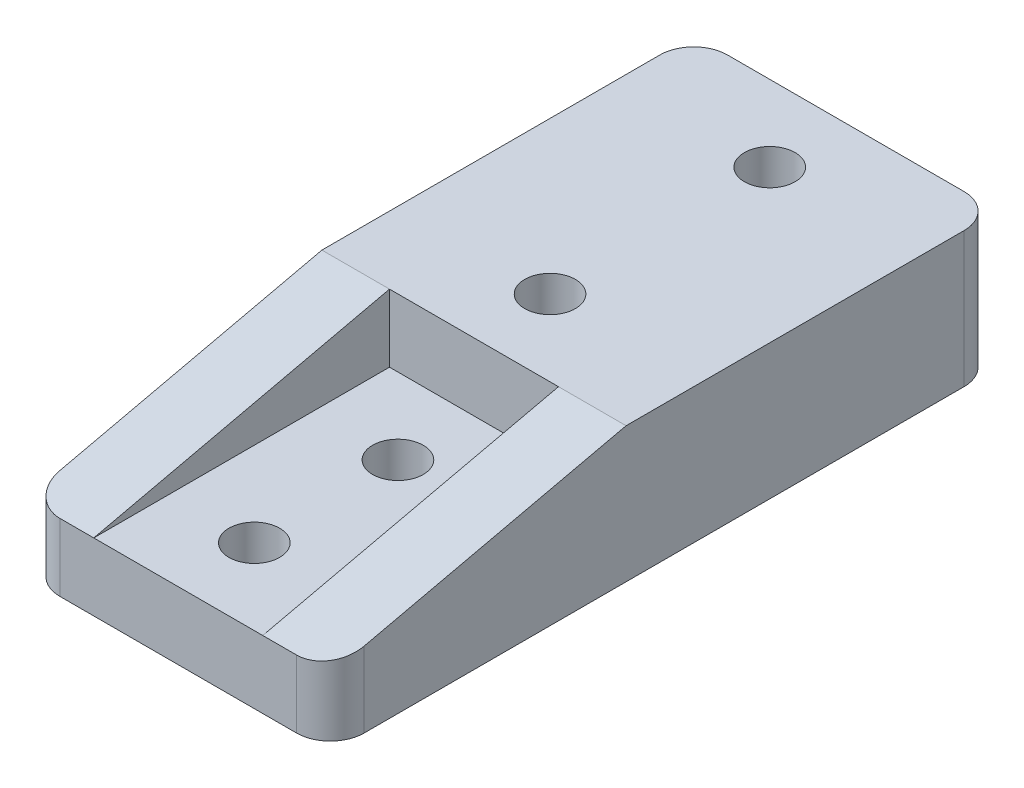
ISO-10303-21;
HEADER;
FILE_DESCRIPTION(('STEP AP214'),'2;1');
FILE_NAME('part.step','',(''),(''),'','','');
FILE_SCHEMA(('AUTOMOTIVE_DESIGN { 1 0 10303 214 1 1 1 1 }'));
ENDSEC;
DATA;
#1=APPLICATION_CONTEXT('core data for automotive mechanical design processes');
#2=APPLICATION_PROTOCOL_DEFINITION('international standard','automotive_design',2000,#1);
#3=PRODUCT_CONTEXT('',#1,'mechanical');
#4=PRODUCT('Part','Part','',(#3));
#5=PRODUCT_RELATED_PRODUCT_CATEGORY('part','',(#4));
#6=PRODUCT_DEFINITION_FORMATION('','',#4);
#7=PRODUCT_DEFINITION_CONTEXT('part definition',#1,'design');
#8=PRODUCT_DEFINITION('design','',#6,#7);
#9=PRODUCT_DEFINITION_SHAPE('','',#8);
#10=(LENGTH_UNIT() NAMED_UNIT(*) SI_UNIT(.MILLI.,.METRE.));
#11=(NAMED_UNIT(*) PLANE_ANGLE_UNIT() SI_UNIT($,.RADIAN.));
#12=(NAMED_UNIT(*) SI_UNIT($,.STERADIAN.) SOLID_ANGLE_UNIT());
#13=UNCERTAINTY_MEASURE_WITH_UNIT(LENGTH_MEASURE(1.E-05),#10,'distance_accuracy_value','');
#14=(GEOMETRIC_REPRESENTATION_CONTEXT(3) GLOBAL_UNCERTAINTY_ASSIGNED_CONTEXT((#13)) GLOBAL_UNIT_ASSIGNED_CONTEXT((#10,
#11,#12)) REPRESENTATION_CONTEXT('',''));
#15=CARTESIAN_POINT('',(0.,0.,0.));
#16=DIRECTION('',(0.,0.,1.));
#17=DIRECTION('',(1.,0.,0.));
#18=AXIS2_PLACEMENT_3D('',#15,#16,#17);
#19=CARTESIAN_POINT('',(0.,0.,6.));
#20=DIRECTION('',(0.,1.,0.));
#21=DIRECTION('',(0.,0.,1.));
#22=AXIS2_PLACEMENT_3D('',#19,#20,#21);
#23=CYLINDRICAL_SURFACE('',#22,1.5);
#24=CARTESIAN_POINT('',(0.,8.,6.));
#25=DIRECTION('',(0.,1.,0.));
#26=DIRECTION('',(0.,0.,1.));
#27=AXIS2_PLACEMENT_3D('',#24,#25,#26);
#28=CIRCLE('',#27,1.5);
#29=CARTESIAN_POINT('',(0.,8.,7.5));
#30=VERTEX_POINT('',#29);
#31=EDGE_CURVE('E347',#30,#30,#28,.T.);
#32=ORIENTED_EDGE('',*,*,#31,.T.);
#33=EDGE_LOOP('',(#32));
#34=FACE_BOUND('',#33,.T.);
#35=CARTESIAN_POINT('',(0.,3.,6.));
#36=DIRECTION('',(0.,-1.,0.));
#37=DIRECTION('',(0.,0.,-1.));
#38=AXIS2_PLACEMENT_3D('',#35,#36,#37);
#39=CIRCLE('',#38,1.5);
#40=CARTESIAN_POINT('',(0.,3.,4.5));
#41=VERTEX_POINT('',#40);
#42=EDGE_CURVE('E206',#41,#41,#39,.F.);
#43=ORIENTED_EDGE('',*,*,#42,.F.);
#44=EDGE_LOOP('',(#43));
#45=FACE_BOUND('',#44,.T.);
#46=ADVANCED_FACE('F31',(#34,#45),#23,.F.);
#47=CARTESIAN_POINT('',(-8.99999999999999,8.,28.));
#48=DIRECTION('',(0.,0.,-1.));
#49=DIRECTION('',(-1.,0.,0.));
#50=AXIS2_PLACEMENT_3D('',#47,#48,#49);
#51=PLANE('',#50);
#52=DIRECTION('',(1.,0.,0.));
#53=VECTOR('',#52,1.);
#54=CARTESIAN_POINT('',(-9.,4.,28.));
#55=LINE('',#54,#53);
#56=CARTESIAN_POINT('',(-6.99999999999999,4.,28.));
#57=VERTEX_POINT('',#56);
#58=CARTESIAN_POINT('',(-5.,4.,28.));
#59=VERTEX_POINT('',#58);
#60=EDGE_CURVE('E154',#57,#59,#55,.T.);
#61=ORIENTED_EDGE('',*,*,#60,.F.);
#62=DIRECTION('',(0.,-1.,0.));
#63=VECTOR('',#62,1.);
#64=CARTESIAN_POINT('',(-6.99999999999999,8.,28.));
#65=LINE('',#64,#63);
#66=CARTESIAN_POINT('',(-6.99999999999999,0.,28.));
#67=VERTEX_POINT('',#66);
#68=EDGE_CURVE('E189',#57,#67,#65,.T.);
#69=ORIENTED_EDGE('',*,*,#68,.T.);
#70=DIRECTION('',(1.,0.,0.));
#71=VECTOR('',#70,1.);
#72=CARTESIAN_POINT('',(-8.99999999999999,0.,28.));
#73=LINE('',#72,#71);
#74=CARTESIAN_POINT('',(7.,0.,28.));
#75=VERTEX_POINT('',#74);
#76=EDGE_CURVE('E182',#67,#75,#73,.T.);
#77=ORIENTED_EDGE('',*,*,#76,.T.);
#78=DIRECTION('',(0.,-1.,0.));
#79=VECTOR('',#78,1.);
#80=CARTESIAN_POINT('',(7.,8.,28.));
#81=LINE('',#80,#79);
#82=CARTESIAN_POINT('',(7.,4.,28.));
#83=VERTEX_POINT('',#82);
#84=EDGE_CURVE('E180',#75,#83,#81,.F.);
#85=ORIENTED_EDGE('',*,*,#84,.T.);
#86=CARTESIAN_POINT('',(5.,4.,28.));
#87=VERTEX_POINT('',#86);
#88=EDGE_CURVE('E143',#87,#83,#55,.T.);
#89=ORIENTED_EDGE('',*,*,#88,.F.);
#90=DIRECTION('',(1.,0.,0.));
#91=VECTOR('',#90,1.);
#92=CARTESIAN_POINT('',(-33.9048816350654,4.,28.));
#93=LINE('',#92,#91);
#94=EDGE_CURVE('E167',#59,#87,#93,.T.);
#95=ORIENTED_EDGE('',*,*,#94,.F.);
#96=EDGE_LOOP('',(#61,#69,#77,#85,#89,#95));
#97=FACE_BOUND('',#96,.T.);
#98=ADVANCED_FACE('F240',(#97),#51,.F.);
#99=CARTESIAN_POINT('',(-8.99999999999999,8.,28.));
#100=DIRECTION('',(0.,1.,0.));
#101=DIRECTION('',(0.,0.,1.));
#102=AXIS2_PLACEMENT_3D('',#99,#100,#101);
#103=PLANE('',#102);
#104=CARTESIAN_POINT('',(0.,8.,-7.));
#105=DIRECTION('',(0.,1.,0.));
#106=DIRECTION('',(0.,0.,1.));
#107=AXIS2_PLACEMENT_3D('',#104,#105,#106);
#108=CIRCLE('',#107,1.5);
#109=CARTESIAN_POINT('',(0.,8.,-5.5));
#110=VERTEX_POINT('',#109);
#111=EDGE_CURVE('E341',#110,#110,#108,.T.);
#112=ORIENTED_EDGE('',*,*,#111,.F.);
#113=EDGE_LOOP('',(#112));
#114=FACE_BOUND('',#113,.T.);
#115=ORIENTED_EDGE('',*,*,#31,.F.);
#116=EDGE_LOOP('',(#115));
#117=FACE_BOUND('',#116,.T.);
#118=DIRECTION('',(-1.,0.,0.));
#119=VECTOR('',#118,1.);
#120=CARTESIAN_POINT('',(-9.,8.,-11.5));
#121=LINE('',#120,#119);
#122=CARTESIAN_POINT('',(6.99999999999999,8.,-11.5));
#123=VERTEX_POINT('',#122);
#124=CARTESIAN_POINT('',(-7.,8.,-11.5));
#125=VERTEX_POINT('',#124);
#126=EDGE_CURVE('E178',#123,#125,#121,.T.);
#127=ORIENTED_EDGE('',*,*,#126,.T.);
#128=CARTESIAN_POINT('',(-7.,8.,-9.5));
#129=DIRECTION('',(0.,1.,0.));
#130=DIRECTION('',(0.,0.,1.));
#131=AXIS2_PLACEMENT_3D('',#128,#129,#130);
#132=CIRCLE('',#131,2.);
#133=CARTESIAN_POINT('',(-9.,8.,-9.5));
#134=VERTEX_POINT('',#133);
#135=EDGE_CURVE('E39',#125,#134,#132,.T.);
#136=ORIENTED_EDGE('',*,*,#135,.T.);
#137=DIRECTION('',(0.,0.,1.));
#138=VECTOR('',#137,1.);
#139=CARTESIAN_POINT('',(-9.,8.,-11.5));
#140=LINE('',#139,#138);
#141=CARTESIAN_POINT('',(-9.,8.,10.5));
#142=VERTEX_POINT('',#141);
#143=EDGE_CURVE('E122',#134,#142,#140,.T.);
#144=ORIENTED_EDGE('',*,*,#143,.T.);
#145=DIRECTION('',(1.,0.,0.));
#146=VECTOR('',#145,1.);
#147=CARTESIAN_POINT('',(-9.,8.,10.5));
#148=LINE('',#147,#146);
#149=CARTESIAN_POINT('',(-5.,8.,10.5));
#150=VERTEX_POINT('',#149);
#151=EDGE_CURVE('E127',#142,#150,#148,.T.);
#152=ORIENTED_EDGE('',*,*,#151,.T.);
#153=DIRECTION('',(1.,0.,0.));
#154=VECTOR('',#153,1.);
#155=CARTESIAN_POINT('',(-33.9048816350654,8.,10.5));
#156=LINE('',#155,#154);
#157=CARTESIAN_POINT('',(5.,8.,10.5));
#158=VERTEX_POINT('',#157);
#159=EDGE_CURVE('E159',#150,#158,#156,.T.);
#160=ORIENTED_EDGE('',*,*,#159,.T.);
#161=CARTESIAN_POINT('',(9.,8.,10.5));
#162=VERTEX_POINT('',#161);
#163=EDGE_CURVE('E149',#158,#162,#148,.T.);
#164=ORIENTED_EDGE('',*,*,#163,.T.);
#165=DIRECTION('',(0.,0.,-1.));
#166=VECTOR('',#165,1.);
#167=CARTESIAN_POINT('',(9.,8.,-11.5));
#168=LINE('',#167,#166);
#169=CARTESIAN_POINT('',(9.,8.,-9.5));
#170=VERTEX_POINT('',#169);
#171=EDGE_CURVE('E133',#162,#170,#168,.T.);
#172=ORIENTED_EDGE('',*,*,#171,.T.);
#173=CARTESIAN_POINT('',(6.99999999999999,8.,-9.5));
#174=DIRECTION('',(0.,1.,0.));
#175=DIRECTION('',(0.,0.,1.));
#176=AXIS2_PLACEMENT_3D('',#173,#174,#175);
#177=CIRCLE('',#176,2.);
#178=EDGE_CURVE('E220',#170,#123,#177,.T.);
#179=ORIENTED_EDGE('',*,*,#178,.T.);
#180=EDGE_LOOP('',(#127,#136,#144,#152,#160,#164,#172,#179));
#181=FACE_BOUND('',#180,.T.);
#182=ADVANCED_FACE('F124',(#114,#117,#181),#103,.T.);
#183=CARTESIAN_POINT('',(-9.,8.,-11.5));
#184=DIRECTION('',(1.,0.,0.));
#185=DIRECTION('',(0.,0.,-1.));
#186=AXIS2_PLACEMENT_3D('',#183,#184,#185);
#187=PLANE('',#186);
#188=ORIENTED_EDGE('',*,*,#143,.F.);
#189=DIRECTION('',(0.,-1.,0.));
#190=VECTOR('',#189,1.);
#191=CARTESIAN_POINT('',(-9.,8.,-9.5));
#192=LINE('',#191,#190);
#193=CARTESIAN_POINT('',(-9.,0.,-9.5));
#194=VERTEX_POINT('',#193);
#195=EDGE_CURVE('E205',#134,#194,#192,.T.);
#196=ORIENTED_EDGE('',*,*,#195,.T.);
#197=DIRECTION('',(0.,0.,1.));
#198=VECTOR('',#197,1.);
#199=CARTESIAN_POINT('',(-9.,0.,-11.5));
#200=LINE('',#199,#198);
#201=CARTESIAN_POINT('',(-8.99999999999999,0.,26.));
#202=VERTEX_POINT('',#201);
#203=EDGE_CURVE('E174',#194,#202,#200,.T.);
#204=ORIENTED_EDGE('',*,*,#203,.T.);
#205=DIRECTION('',(0.,-1.,0.));
#206=VECTOR('',#205,1.);
#207=CARTESIAN_POINT('',(-8.99999999999999,8.,26.));
#208=LINE('',#207,#206);
#209=CARTESIAN_POINT('',(-9.,4.45714285714286,26.));
#210=VERTEX_POINT('',#209);
#211=EDGE_CURVE('E140',#202,#210,#208,.F.);
#212=ORIENTED_EDGE('',*,*,#211,.T.);
#213=DIRECTION('',(0.,0.222824801502141,-0.974858506571867));
#214=VECTOR('',#213,1.);
#215=CARTESIAN_POINT('',(-9.,4.,28.));
#216=LINE('',#215,#214);
#217=EDGE_CURVE('E137',#210,#142,#216,.T.);
#218=ORIENTED_EDGE('',*,*,#217,.T.);
#219=EDGE_LOOP('',(#188,#196,#204,#212,#218));
#220=FACE_BOUND('',#219,.T.);
#221=ADVANCED_FACE('F138',(#220),#187,.F.);
#222=CARTESIAN_POINT('',(9.,8.,-11.5));
#223=DIRECTION('',(-1.,0.,0.));
#224=DIRECTION('',(0.,0.,1.));
#225=AXIS2_PLACEMENT_3D('',#222,#223,#224);
#226=PLANE('',#225);
#227=DIRECTION('',(0.,0.,-1.));
#228=VECTOR('',#227,1.);
#229=CARTESIAN_POINT('',(9.,0.,-11.5));
#230=LINE('',#229,#228);
#231=CARTESIAN_POINT('',(9.,0.,26.));
#232=VERTEX_POINT('',#231);
#233=CARTESIAN_POINT('',(9.,0.,-9.5));
#234=VERTEX_POINT('',#233);
#235=EDGE_CURVE('E185',#232,#234,#230,.T.);
#236=ORIENTED_EDGE('',*,*,#235,.T.);
#237=DIRECTION('',(0.,-1.,0.));
#238=VECTOR('',#237,1.);
#239=CARTESIAN_POINT('',(9.,8.,-9.5));
#240=LINE('',#239,#238);
#241=EDGE_CURVE('E11',#234,#170,#240,.F.);
#242=ORIENTED_EDGE('',*,*,#241,.T.);
#243=ORIENTED_EDGE('',*,*,#171,.F.);
#244=DIRECTION('',(0.,0.222824801502141,-0.974858506571867));
#245=VECTOR('',#244,1.);
#246=CARTESIAN_POINT('',(9.,4.,28.));
#247=LINE('',#246,#245);
#248=CARTESIAN_POINT('',(9.,4.45714285714286,26.));
#249=VERTEX_POINT('',#248);
#250=EDGE_CURVE('E144',#249,#162,#247,.T.);
#251=ORIENTED_EDGE('',*,*,#250,.F.);
#252=DIRECTION('',(0.,-1.,0.));
#253=VECTOR('',#252,1.);
#254=CARTESIAN_POINT('',(9.,8.,26.));
#255=LINE('',#254,#253);
#256=EDGE_CURVE('E200',#249,#232,#255,.T.);
#257=ORIENTED_EDGE('',*,*,#256,.T.);
#258=EDGE_LOOP('',(#236,#242,#243,#251,#257));
#259=FACE_BOUND('',#258,.T.);
#260=ADVANCED_FACE('F230',(#259),#226,.F.);
#261=CARTESIAN_POINT('',(-9.,8.,-11.5));
#262=DIRECTION('',(0.,0.,1.));
#263=DIRECTION('',(1.,0.,0.));
#264=AXIS2_PLACEMENT_3D('',#261,#262,#263);
#265=PLANE('',#264);
#266=DIRECTION('',(-1.,0.,0.));
#267=VECTOR('',#266,1.);
#268=CARTESIAN_POINT('',(-9.,0.,-11.5));
#269=LINE('',#268,#267);
#270=CARTESIAN_POINT('',(6.99999999999999,0.,-11.5));
#271=VERTEX_POINT('',#270);
#272=CARTESIAN_POINT('',(-7.,0.,-11.5));
#273=VERTEX_POINT('',#272);
#274=EDGE_CURVE('E134',#271,#273,#269,.T.);
#275=ORIENTED_EDGE('',*,*,#274,.T.);
#276=DIRECTION('',(0.,-1.,0.));
#277=VECTOR('',#276,1.);
#278=CARTESIAN_POINT('',(-7.,8.,-11.5));
#279=LINE('',#278,#277);
#280=EDGE_CURVE('E52',#273,#125,#279,.F.);
#281=ORIENTED_EDGE('',*,*,#280,.T.);
#282=ORIENTED_EDGE('',*,*,#126,.F.);
#283=DIRECTION('',(0.,-1.,0.));
#284=VECTOR('',#283,1.);
#285=CARTESIAN_POINT('',(6.99999999999999,8.,-11.5));
#286=LINE('',#285,#284);
#287=EDGE_CURVE('E216',#123,#271,#286,.T.);
#288=ORIENTED_EDGE('',*,*,#287,.T.);
#289=EDGE_LOOP('',(#275,#281,#282,#288));
#290=FACE_BOUND('',#289,.T.);
#291=ADVANCED_FACE('F224',(#290),#265,.F.);
#292=CARTESIAN_POINT('',(-8.99999999999999,0.,28.));
#293=DIRECTION('',(0.,1.,0.));
#294=DIRECTION('',(0.,0.,1.));
#295=AXIS2_PLACEMENT_3D('',#292,#293,#294);
#296=PLANE('',#295);
#297=CARTESIAN_POINT('',(0.,0.,6.));
#298=DIRECTION('',(0.,-1.,0.));
#299=DIRECTION('',(0.,0.,-1.));
#300=AXIS2_PLACEMENT_3D('',#297,#298,#299);
#301=CIRCLE('',#300,3.5);
#302=CARTESIAN_POINT('',(0.,0.,2.5));
#303=VERTEX_POINT('',#302);
#304=EDGE_CURVE('E327',#303,#303,#301,.T.);
#305=ORIENTED_EDGE('',*,*,#304,.F.);
#306=EDGE_LOOP('',(#305));
#307=FACE_BOUND('',#306,.T.);
#308=CARTESIAN_POINT('',(0.,0.,23.5));
#309=DIRECTION('',(0.,1.,0.));
#310=DIRECTION('',(0.,0.,1.));
#311=AXIS2_PLACEMENT_3D('',#308,#309,#310);
#312=CIRCLE('',#311,1.5);
#313=CARTESIAN_POINT('',(0.,0.,25.));
#314=VERTEX_POINT('',#313);
#315=EDGE_CURVE('E332',#314,#314,#312,.T.);
#316=ORIENTED_EDGE('',*,*,#315,.T.);
#317=EDGE_LOOP('',(#316));
#318=FACE_BOUND('',#317,.T.);
#319=CARTESIAN_POINT('',(0.,0.,15.));
#320=DIRECTION('',(0.,1.,0.));
#321=DIRECTION('',(0.,0.,1.));
#322=AXIS2_PLACEMENT_3D('',#319,#320,#321);
#323=CIRCLE('',#322,1.5);
#324=CARTESIAN_POINT('',(0.,0.,16.5));
#325=VERTEX_POINT('',#324);
#326=EDGE_CURVE('E338',#325,#325,#323,.T.);
#327=ORIENTED_EDGE('',*,*,#326,.T.);
#328=EDGE_LOOP('',(#327));
#329=FACE_BOUND('',#328,.T.);
#330=CARTESIAN_POINT('',(0.,0.,-7.));
#331=DIRECTION('',(0.,1.,0.));
#332=DIRECTION('',(0.,0.,1.));
#333=AXIS2_PLACEMENT_3D('',#330,#331,#332);
#334=CIRCLE('',#333,1.5);
#335=CARTESIAN_POINT('',(0.,0.,-5.5));
#336=VERTEX_POINT('',#335);
#337=EDGE_CURVE('E344',#336,#336,#334,.T.);
#338=ORIENTED_EDGE('',*,*,#337,.T.);
#339=EDGE_LOOP('',(#338));
#340=FACE_BOUND('',#339,.T.);
#341=ORIENTED_EDGE('',*,*,#203,.F.);
#342=CARTESIAN_POINT('',(-7.,0.,-9.5));
#343=DIRECTION('',(0.,1.,0.));
#344=DIRECTION('',(0.,0.,1.));
#345=AXIS2_PLACEMENT_3D('',#342,#343,#344);
#346=CIRCLE('',#345,2.);
#347=EDGE_CURVE('E214',#194,#273,#346,.F.);
#348=ORIENTED_EDGE('',*,*,#347,.T.);
#349=ORIENTED_EDGE('',*,*,#274,.F.);
#350=CARTESIAN_POINT('',(6.99999999999999,0.,-9.5));
#351=DIRECTION('',(0.,1.,0.));
#352=DIRECTION('',(0.,0.,1.));
#353=AXIS2_PLACEMENT_3D('',#350,#351,#352);
#354=CIRCLE('',#353,2.);
#355=EDGE_CURVE('E212',#271,#234,#354,.F.);
#356=ORIENTED_EDGE('',*,*,#355,.T.);
#357=ORIENTED_EDGE('',*,*,#235,.F.);
#358=CARTESIAN_POINT('',(7.,0.,26.));
#359=DIRECTION('',(0.,1.,0.));
#360=DIRECTION('',(0.,0.,1.));
#361=AXIS2_PLACEMENT_3D('',#358,#359,#360);
#362=CIRCLE('',#361,2.);
#363=EDGE_CURVE('E192',#232,#75,#362,.F.);
#364=ORIENTED_EDGE('',*,*,#363,.T.);
#365=ORIENTED_EDGE('',*,*,#76,.F.);
#366=CARTESIAN_POINT('',(-6.99999999999999,0.,26.));
#367=DIRECTION('',(0.,1.,0.));
#368=DIRECTION('',(0.,0.,1.));
#369=AXIS2_PLACEMENT_3D('',#366,#367,#368);
#370=CIRCLE('',#369,2.);
#371=EDGE_CURVE('E194',#67,#202,#370,.F.);
#372=ORIENTED_EDGE('',*,*,#371,.T.);
#373=EDGE_LOOP('',(#341,#348,#349,#356,#357,#364,#365,#372));
#374=FACE_BOUND('',#373,.T.);
#375=ADVANCED_FACE('F229',(#307,#318,#329,#340,#374),#296,.F.);
#376=CARTESIAN_POINT('',(5.,4.,8.25000000000001));
#377=DIRECTION('',(-1.,0.,0.));
#378=DIRECTION('',(0.,0.,1.));
#379=AXIS2_PLACEMENT_3D('',#376,#377,#378);
#380=PLANE('',#379);
#381=DIRECTION('',(0.,-0.222824801502141,0.974858506571867));
#382=VECTOR('',#381,1.);
#383=CARTESIAN_POINT('',(5.,8.29014740108611,9.23060512024826));
#384=LINE('',#383,#382);
#385=EDGE_CURVE('E151',#158,#87,#384,.T.);
#386=ORIENTED_EDGE('',*,*,#385,.F.);
#387=DIRECTION('',(0.,1.,0.));
#388=VECTOR('',#387,1.);
#389=CARTESIAN_POINT('',(5.,4.,10.5));
#390=LINE('',#389,#388);
#391=CARTESIAN_POINT('',(5.,4.,10.5));
#392=VERTEX_POINT('',#391);
#393=EDGE_CURVE('E170',#392,#158,#390,.T.);
#394=ORIENTED_EDGE('',*,*,#393,.F.);
#395=DIRECTION('',(0.,0.,1.));
#396=VECTOR('',#395,1.);
#397=CARTESIAN_POINT('',(5.,4.,8.25000000000001));
#398=LINE('',#397,#396);
#399=EDGE_CURVE('E160',#392,#87,#398,.T.);
#400=ORIENTED_EDGE('',*,*,#399,.T.);
#401=EDGE_LOOP('',(#386,#394,#400));
#402=FACE_BOUND('',#401,.T.);
#403=ADVANCED_FACE('F283',(#402),#380,.T.);
#404=CARTESIAN_POINT('',(-5.,4.,8.25));
#405=DIRECTION('',(1.,0.,0.));
#406=DIRECTION('',(0.,0.,-1.));
#407=AXIS2_PLACEMENT_3D('',#404,#405,#406);
#408=PLANE('',#407);
#409=DIRECTION('',(0.,0.222824801502141,-0.974858506571867));
#410=VECTOR('',#409,1.);
#411=CARTESIAN_POINT('',(-5.,8.29014740108611,9.23060512024826));
#412=LINE('',#411,#410);
#413=EDGE_CURVE('E148',#59,#150,#412,.T.);
#414=ORIENTED_EDGE('',*,*,#413,.F.);
#415=DIRECTION('',(0.,0.,-1.));
#416=VECTOR('',#415,1.);
#417=CARTESIAN_POINT('',(-5.,4.,8.25));
#418=LINE('',#417,#416);
#419=CARTESIAN_POINT('',(-5.,4.,10.5));
#420=VERTEX_POINT('',#419);
#421=EDGE_CURVE('E165',#59,#420,#418,.T.);
#422=ORIENTED_EDGE('',*,*,#421,.T.);
#423=DIRECTION('',(0.,1.,0.));
#424=VECTOR('',#423,1.);
#425=CARTESIAN_POINT('',(-5.,4.,10.5));
#426=LINE('',#425,#424);
#427=EDGE_CURVE('E172',#420,#150,#426,.T.);
#428=ORIENTED_EDGE('',*,*,#427,.T.);
#429=EDGE_LOOP('',(#414,#422,#428));
#430=FACE_BOUND('',#429,.T.);
#431=ADVANCED_FACE('F280',(#430),#408,.T.);
#432=CARTESIAN_POINT('',(-33.9048816350654,4.,10.5));
#433=DIRECTION('',(0.,0.,1.));
#434=DIRECTION('',(1.,0.,0.));
#435=AXIS2_PLACEMENT_3D('',#432,#433,#434);
#436=PLANE('',#435);
#437=ORIENTED_EDGE('',*,*,#159,.F.);
#438=ORIENTED_EDGE('',*,*,#427,.F.);
#439=DIRECTION('',(1.,0.,0.));
#440=VECTOR('',#439,1.);
#441=CARTESIAN_POINT('',(-33.9048816350654,4.,10.5));
#442=LINE('',#441,#440);
#443=EDGE_CURVE('E163',#420,#392,#442,.T.);
#444=ORIENTED_EDGE('',*,*,#443,.T.);
#445=ORIENTED_EDGE('',*,*,#393,.T.);
#446=EDGE_LOOP('',(#437,#438,#444,#445));
#447=FACE_BOUND('',#446,.T.);
#448=ADVANCED_FACE('F278',(#447),#436,.T.);
#449=CARTESIAN_POINT('',(-33.9048816350654,4.,8.25000000000001));
#450=DIRECTION('',(0.,1.,0.));
#451=DIRECTION('',(0.,0.,1.));
#452=AXIS2_PLACEMENT_3D('',#449,#450,#451);
#453=PLANE('',#452);
#454=CARTESIAN_POINT('',(0.,4.,23.5));
#455=DIRECTION('',(0.,1.,0.));
#456=DIRECTION('',(0.,0.,1.));
#457=AXIS2_PLACEMENT_3D('',#454,#455,#456);
#458=CIRCLE('',#457,1.5);
#459=CARTESIAN_POINT('',(0.,4.,25.));
#460=VERTEX_POINT('',#459);
#461=EDGE_CURVE('E209',#460,#460,#458,.T.);
#462=ORIENTED_EDGE('',*,*,#461,.F.);
#463=EDGE_LOOP('',(#462));
#464=FACE_BOUND('',#463,.T.);
#465=CARTESIAN_POINT('',(0.,4.,15.));
#466=DIRECTION('',(0.,1.,0.));
#467=DIRECTION('',(0.,0.,1.));
#468=AXIS2_PLACEMENT_3D('',#465,#466,#467);
#469=CIRCLE('',#468,1.5);
#470=CARTESIAN_POINT('',(0.,4.,16.5));
#471=VERTEX_POINT('',#470);
#472=EDGE_CURVE('E335',#471,#471,#469,.T.);
#473=ORIENTED_EDGE('',*,*,#472,.F.);
#474=EDGE_LOOP('',(#473));
#475=FACE_BOUND('',#474,.T.);
#476=ORIENTED_EDGE('',*,*,#399,.F.);
#477=ORIENTED_EDGE('',*,*,#443,.F.);
#478=ORIENTED_EDGE('',*,*,#421,.F.);
#479=ORIENTED_EDGE('',*,*,#94,.T.);
#480=EDGE_LOOP('',(#476,#477,#478,#479));
#481=FACE_BOUND('',#480,.T.);
#482=ADVANCED_FACE('F275',(#464,#475,#481),#453,.T.);
#483=CARTESIAN_POINT('',(-9.,4.,28.));
#484=DIRECTION('',(0.,-0.974858506571867,-0.222824801502141));
#485=DIRECTION('',(0.,0.222824801502141,-0.974858506571867));
#486=AXIS2_PLACEMENT_3D('',#483,#484,#485);
#487=PLANE('',#486);
#488=ORIENTED_EDGE('',*,*,#217,.F.);
#489=CARTESIAN_POINT('',(-6.99999999999999,4.45714285714286,26.));
#490=DIRECTION('',(0.,-0.974858506571867,-0.222824801502141));
#491=DIRECTION('',(0.,-0.222824801502141,0.974858506571867));
#492=AXIS2_PLACEMENT_3D('',#489,#490,#491);
#493=ELLIPSE('',#492,2.05157977954471,2.);
#494=EDGE_CURVE('E198',#210,#57,#493,.F.);
#495=ORIENTED_EDGE('',*,*,#494,.T.);
#496=ORIENTED_EDGE('',*,*,#60,.T.);
#497=ORIENTED_EDGE('',*,*,#413,.T.);
#498=ORIENTED_EDGE('',*,*,#151,.F.);
#499=EDGE_LOOP('',(#488,#495,#496,#497,#498));
#500=FACE_BOUND('',#499,.T.);
#501=ADVANCED_FACE('F146',(#500),#487,.F.);
#502=ORIENTED_EDGE('',*,*,#88,.T.);
#503=CARTESIAN_POINT('',(7.,4.45714285714286,26.));
#504=DIRECTION('',(0.,-0.974858506571867,-0.222824801502141));
#505=DIRECTION('',(0.,-0.222824801502141,0.974858506571867));
#506=AXIS2_PLACEMENT_3D('',#503,#504,#505);
#507=ELLIPSE('',#506,2.05157977954471,2.);
#508=EDGE_CURVE('E203',#83,#249,#507,.F.);
#509=ORIENTED_EDGE('',*,*,#508,.T.);
#510=ORIENTED_EDGE('',*,*,#250,.T.);
#511=ORIENTED_EDGE('',*,*,#163,.F.);
#512=ORIENTED_EDGE('',*,*,#385,.T.);
#513=EDGE_LOOP('',(#502,#509,#510,#511,#512));
#514=FACE_BOUND('',#513,.T.);
#515=ADVANCED_FACE('F274',(#514),#487,.F.);
#516=CARTESIAN_POINT('',(0.,0.,-7.));
#517=DIRECTION('',(0.,1.,0.));
#518=DIRECTION('',(0.,0.,1.));
#519=AXIS2_PLACEMENT_3D('',#516,#517,#518);
#520=CYLINDRICAL_SURFACE('',#519,1.5);
#521=ORIENTED_EDGE('',*,*,#337,.F.);
#522=EDGE_LOOP('',(#521));
#523=FACE_BOUND('',#522,.T.);
#524=ORIENTED_EDGE('',*,*,#111,.T.);
#525=EDGE_LOOP('',(#524));
#526=FACE_BOUND('',#525,.T.);
#527=ADVANCED_FACE('F270',(#523,#526),#520,.F.);
#528=CARTESIAN_POINT('',(-6.99999999999999,8.,26.));
#529=DIRECTION('',(0.,-1.,0.));
#530=DIRECTION('',(0.,0.,-1.));
#531=AXIS2_PLACEMENT_3D('',#528,#529,#530);
#532=CYLINDRICAL_SURFACE('',#531,2.);
#533=ORIENTED_EDGE('',*,*,#494,.F.);
#534=ORIENTED_EDGE('',*,*,#211,.F.);
#535=ORIENTED_EDGE('',*,*,#371,.F.);
#536=ORIENTED_EDGE('',*,*,#68,.F.);
#537=EDGE_LOOP('',(#533,#534,#535,#536));
#538=FACE_BOUND('',#537,.T.);
#539=ADVANCED_FACE('F246',(#538),#532,.T.);
#540=CARTESIAN_POINT('',(7.,8.,26.));
#541=DIRECTION('',(0.,-1.,0.));
#542=DIRECTION('',(0.,0.,-1.));
#543=AXIS2_PLACEMENT_3D('',#540,#541,#542);
#544=CYLINDRICAL_SURFACE('',#543,2.);
#545=ORIENTED_EDGE('',*,*,#508,.F.);
#546=ORIENTED_EDGE('',*,*,#84,.F.);
#547=ORIENTED_EDGE('',*,*,#363,.F.);
#548=ORIENTED_EDGE('',*,*,#256,.F.);
#549=EDGE_LOOP('',(#545,#546,#547,#548));
#550=FACE_BOUND('',#549,.T.);
#551=ADVANCED_FACE('F235',(#550),#544,.T.);
#552=CARTESIAN_POINT('',(0.,0.,15.));
#553=DIRECTION('',(0.,1.,0.));
#554=DIRECTION('',(0.,0.,1.));
#555=AXIS2_PLACEMENT_3D('',#552,#553,#554);
#556=CYLINDRICAL_SURFACE('',#555,1.5);
#557=ORIENTED_EDGE('',*,*,#326,.F.);
#558=EDGE_LOOP('',(#557));
#559=FACE_BOUND('',#558,.T.);
#560=ORIENTED_EDGE('',*,*,#472,.T.);
#561=EDGE_LOOP('',(#560));
#562=FACE_BOUND('',#561,.T.);
#563=ADVANCED_FACE('F305',(#559,#562),#556,.F.);
#564=CARTESIAN_POINT('',(0.,0.,23.5));
#565=DIRECTION('',(0.,1.,0.));
#566=DIRECTION('',(0.,0.,1.));
#567=AXIS2_PLACEMENT_3D('',#564,#565,#566);
#568=CYLINDRICAL_SURFACE('',#567,1.5);
#569=ORIENTED_EDGE('',*,*,#315,.F.);
#570=EDGE_LOOP('',(#569));
#571=FACE_BOUND('',#570,.T.);
#572=ORIENTED_EDGE('',*,*,#461,.T.);
#573=EDGE_LOOP('',(#572));
#574=FACE_BOUND('',#573,.T.);
#575=ADVANCED_FACE('F309',(#571,#574),#568,.F.);
#576=CARTESIAN_POINT('',(0.,3.,6.));
#577=DIRECTION('',(0.,-1.,0.));
#578=DIRECTION('',(0.,0.,-1.));
#579=AXIS2_PLACEMENT_3D('',#576,#577,#578);
#580=PLANE('',#579);
#581=CARTESIAN_POINT('',(0.,3.,6.));
#582=DIRECTION('',(0.,-1.,0.));
#583=DIRECTION('',(0.,0.,-1.));
#584=AXIS2_PLACEMENT_3D('',#581,#582,#583);
#585=CIRCLE('',#584,3.5);
#586=CARTESIAN_POINT('',(0.,3.,2.5));
#587=VERTEX_POINT('',#586);
#588=EDGE_CURVE('E210',#587,#587,#585,.T.);
#589=ORIENTED_EDGE('',*,*,#588,.T.);
#590=EDGE_LOOP('',(#589));
#591=FACE_BOUND('',#590,.T.);
#592=ORIENTED_EDGE('',*,*,#42,.T.);
#593=EDGE_LOOP('',(#592));
#594=FACE_BOUND('',#593,.T.);
#595=ADVANCED_FACE('F255',(#591,#594),#580,.T.);
#596=CARTESIAN_POINT('',(0.,3.,6.));
#597=DIRECTION('',(0.,-1.,0.));
#598=DIRECTION('',(0.,0.,-1.));
#599=AXIS2_PLACEMENT_3D('',#596,#597,#598);
#600=CYLINDRICAL_SURFACE('',#599,3.5);
#601=ORIENTED_EDGE('',*,*,#588,.F.);
#602=EDGE_LOOP('',(#601));
#603=FACE_BOUND('',#602,.T.);
#604=ORIENTED_EDGE('',*,*,#304,.T.);
#605=EDGE_LOOP('',(#604));
#606=FACE_BOUND('',#605,.T.);
#607=ADVANCED_FACE('F250',(#603,#606),#600,.F.);
#608=CARTESIAN_POINT('',(-7.,8.,-9.5));
#609=DIRECTION('',(0.,-1.,0.));
#610=DIRECTION('',(0.,0.,-1.));
#611=AXIS2_PLACEMENT_3D('',#608,#609,#610);
#612=CYLINDRICAL_SURFACE('',#611,2.);
#613=ORIENTED_EDGE('',*,*,#135,.F.);
#614=ORIENTED_EDGE('',*,*,#280,.F.);
#615=ORIENTED_EDGE('',*,*,#347,.F.);
#616=ORIENTED_EDGE('',*,*,#195,.F.);
#617=EDGE_LOOP('',(#613,#614,#615,#616));
#618=FACE_BOUND('',#617,.T.);
#619=ADVANCED_FACE('F248',(#618),#612,.T.);
#620=CARTESIAN_POINT('',(6.99999999999999,8.,-9.5));
#621=DIRECTION('',(0.,-1.,0.));
#622=DIRECTION('',(0.,0.,-1.));
#623=AXIS2_PLACEMENT_3D('',#620,#621,#622);
#624=CYLINDRICAL_SURFACE('',#623,2.);
#625=ORIENTED_EDGE('',*,*,#178,.F.);
#626=ORIENTED_EDGE('',*,*,#241,.F.);
#627=ORIENTED_EDGE('',*,*,#355,.F.);
#628=ORIENTED_EDGE('',*,*,#287,.F.);
#629=EDGE_LOOP('',(#625,#626,#627,#628));
#630=FACE_BOUND('',#629,.T.);
#631=ADVANCED_FACE('F33',(#630),#624,.T.);
#632=CLOSED_SHELL('',(#46,#98,#182,#221,#260,#291,#375,#403,#431,#448,#482,#501,#515,#527,#539,
#551,#563,#575,#595,#607,#619,#631));
#633=MANIFOLD_SOLID_BREP('B2',#632);
#634=ADVANCED_BREP_SHAPE_REPRESENTATION('',(#18,#633),#14);
#635=SHAPE_DEFINITION_REPRESENTATION(#9,#634);
ENDSEC;
END-ISO-10303-21;
